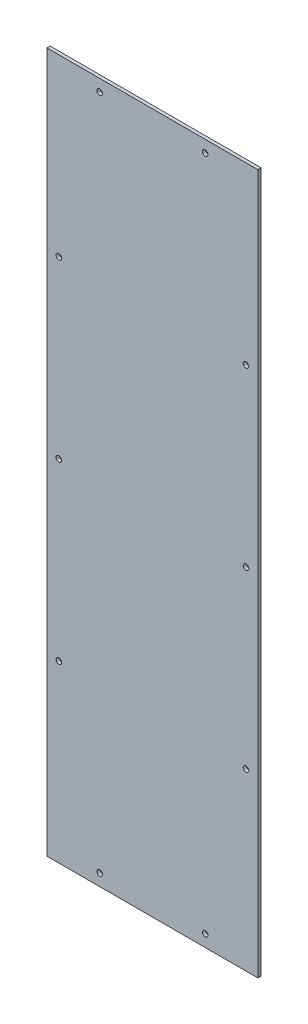
ISO-10303-21;
HEADER;
FILE_DESCRIPTION(('STEP AP214'),'2;1');
FILE_NAME('part.step','',(''),(''),'','','');
FILE_SCHEMA(('AUTOMOTIVE_DESIGN { 1 0 10303 214 1 1 1 1 }'));
ENDSEC;
DATA;
#1=APPLICATION_CONTEXT('core data for automotive mechanical design processes');
#2=APPLICATION_PROTOCOL_DEFINITION('international standard','automotive_design',2000,#1);
#3=PRODUCT_CONTEXT('',#1,'mechanical');
#4=PRODUCT('Part','Part','',(#3));
#5=PRODUCT_RELATED_PRODUCT_CATEGORY('part','',(#4));
#6=PRODUCT_DEFINITION_FORMATION('','',#4);
#7=PRODUCT_DEFINITION_CONTEXT('part definition',#1,'design');
#8=PRODUCT_DEFINITION('design','',#6,#7);
#9=PRODUCT_DEFINITION_SHAPE('','',#8);
#10=(LENGTH_UNIT() NAMED_UNIT(*) SI_UNIT(.MILLI.,.METRE.));
#11=(NAMED_UNIT(*) PLANE_ANGLE_UNIT() SI_UNIT($,.RADIAN.));
#12=(NAMED_UNIT(*) SI_UNIT($,.STERADIAN.) SOLID_ANGLE_UNIT());
#13=UNCERTAINTY_MEASURE_WITH_UNIT(LENGTH_MEASURE(1.E-05),#10,'distance_accuracy_value','');
#14=(GEOMETRIC_REPRESENTATION_CONTEXT(3) GLOBAL_UNCERTAINTY_ASSIGNED_CONTEXT((#13)) GLOBAL_UNIT_ASSIGNED_CONTEXT((#10,
#11,#12)) REPRESENTATION_CONTEXT('',''));
#15=CARTESIAN_POINT('',(0.,0.,0.));
#16=DIRECTION('',(0.,0.,1.));
#17=DIRECTION('',(1.,0.,0.));
#18=AXIS2_PLACEMENT_3D('',#15,#16,#17);
#19=CARTESIAN_POINT('',(-391.552346570397,-405.054151624549,4.));
#20=DIRECTION('',(1.,0.,0.));
#21=DIRECTION('',(0.,0.,-1.));
#22=AXIS2_PLACEMENT_3D('',#19,#20,#21);
#23=PLANE('',#22);
#24=DIRECTION('',(0.,-1.,0.));
#25=VECTOR('',#24,1.);
#26=CARTESIAN_POINT('',(-391.552346570397,-405.054151624549,0.));
#27=LINE('',#26,#25);
#28=CARTESIAN_POINT('',(-391.552346570397,474.945848375451,0.));
#29=VERTEX_POINT('',#28);
#30=CARTESIAN_POINT('',(-391.552346570397,-405.054151624549,0.));
#31=VERTEX_POINT('',#30);
#32=EDGE_CURVE('E112',#29,#31,#27,.T.);
#33=ORIENTED_EDGE('',*,*,#32,.T.);
#34=DIRECTION('',(0.,0.,-1.));
#35=VECTOR('',#34,1.);
#36=CARTESIAN_POINT('',(-391.552346570397,-405.054151624549,4.));
#37=LINE('',#36,#35);
#38=CARTESIAN_POINT('',(-391.552346570397,-405.054151624549,4.));
#39=VERTEX_POINT('',#38);
#40=EDGE_CURVE('E11',#39,#31,#37,.T.);
#41=ORIENTED_EDGE('',*,*,#40,.F.);
#42=DIRECTION('',(0.,-1.,0.));
#43=VECTOR('',#42,1.);
#44=CARTESIAN_POINT('',(-391.552346570397,-405.054151624549,4.));
#45=LINE('',#44,#43);
#46=CARTESIAN_POINT('',(-391.552346570397,474.945848375451,4.));
#47=VERTEX_POINT('',#46);
#48=EDGE_CURVE('E96',#47,#39,#45,.T.);
#49=ORIENTED_EDGE('',*,*,#48,.F.);
#50=DIRECTION('',(0.,0.,-1.));
#51=VECTOR('',#50,1.);
#52=CARTESIAN_POINT('',(-391.552346570397,474.945848375451,4.));
#53=LINE('',#52,#51);
#54=EDGE_CURVE('E108',#47,#29,#53,.T.);
#55=ORIENTED_EDGE('',*,*,#54,.T.);
#56=EDGE_LOOP('',(#33,#41,#49,#55));
#57=FACE_BOUND('',#56,.T.);
#58=ADVANCED_FACE('F44',(#57),#23,.F.);
#59=CARTESIAN_POINT('',(-126.272346570397,-405.054151624549,4.));
#60=DIRECTION('',(0.,1.,0.));
#61=DIRECTION('',(-1.,0.,0.));
#62=AXIS2_PLACEMENT_3D('',#59,#60,#61);
#63=PLANE('',#62);
#64=DIRECTION('',(1.,0.,0.));
#65=VECTOR('',#64,1.);
#66=CARTESIAN_POINT('',(-126.272346570397,-405.054151624549,0.));
#67=LINE('',#66,#65);
#68=CARTESIAN_POINT('',(-126.272346570397,-405.054151624549,0.));
#69=VERTEX_POINT('',#68);
#70=EDGE_CURVE('E101',#31,#69,#67,.T.);
#71=ORIENTED_EDGE('',*,*,#70,.T.);
#72=DIRECTION('',(0.,0.,-1.));
#73=VECTOR('',#72,1.);
#74=CARTESIAN_POINT('',(-126.272346570397,-405.054151624549,4.));
#75=LINE('',#74,#73);
#76=CARTESIAN_POINT('',(-126.272346570397,-405.054151624549,4.));
#77=VERTEX_POINT('',#76);
#78=EDGE_CURVE('E53',#77,#69,#75,.T.);
#79=ORIENTED_EDGE('',*,*,#78,.F.);
#80=DIRECTION('',(1.,0.,0.));
#81=VECTOR('',#80,1.);
#82=CARTESIAN_POINT('',(-126.272346570397,-405.054151624549,4.));
#83=LINE('',#82,#81);
#84=EDGE_CURVE('E91',#39,#77,#83,.T.);
#85=ORIENTED_EDGE('',*,*,#84,.F.);
#86=ORIENTED_EDGE('',*,*,#40,.T.);
#87=EDGE_LOOP('',(#71,#79,#85,#86));
#88=FACE_BOUND('',#87,.T.);
#89=ADVANCED_FACE('F100',(#88),#63,.F.);
#90=CARTESIAN_POINT('',(-126.272346570397,474.945848375451,4.));
#91=DIRECTION('',(-1.,0.,0.));
#92=DIRECTION('',(0.,-1.,0.));
#93=AXIS2_PLACEMENT_3D('',#90,#91,#92);
#94=PLANE('',#93);
#95=DIRECTION('',(0.,1.,0.));
#96=VECTOR('',#95,1.);
#97=CARTESIAN_POINT('',(-126.272346570397,474.945848375451,0.));
#98=LINE('',#97,#96);
#99=CARTESIAN_POINT('',(-126.272346570397,474.945848375451,0.));
#100=VERTEX_POINT('',#99);
#101=EDGE_CURVE('E78',#69,#100,#98,.T.);
#102=ORIENTED_EDGE('',*,*,#101,.T.);
#103=DIRECTION('',(0.,0.,-1.));
#104=VECTOR('',#103,1.);
#105=CARTESIAN_POINT('',(-126.272346570397,474.945848375451,4.));
#106=LINE('',#105,#104);
#107=CARTESIAN_POINT('',(-126.272346570397,474.945848375451,4.));
#108=VERTEX_POINT('',#107);
#109=EDGE_CURVE('E103',#108,#100,#106,.T.);
#110=ORIENTED_EDGE('',*,*,#109,.F.);
#111=DIRECTION('',(0.,1.,0.));
#112=VECTOR('',#111,1.);
#113=CARTESIAN_POINT('',(-126.272346570397,474.945848375451,4.));
#114=LINE('',#113,#112);
#115=EDGE_CURVE('E94',#77,#108,#114,.T.);
#116=ORIENTED_EDGE('',*,*,#115,.F.);
#117=ORIENTED_EDGE('',*,*,#78,.T.);
#118=EDGE_LOOP('',(#102,#110,#116,#117));
#119=FACE_BOUND('',#118,.T.);
#120=ADVANCED_FACE('F104',(#119),#94,.F.);
#121=CARTESIAN_POINT('',(-391.552346570397,474.945848375451,4.));
#122=DIRECTION('',(0.,-1.,0.));
#123=DIRECTION('',(1.,0.,0.));
#124=AXIS2_PLACEMENT_3D('',#121,#122,#123);
#125=PLANE('',#124);
#126=DIRECTION('',(-1.,0.,0.));
#127=VECTOR('',#126,1.);
#128=CARTESIAN_POINT('',(-391.552346570397,474.945848375451,0.));
#129=LINE('',#128,#127);
#130=EDGE_CURVE('E84',#100,#29,#129,.T.);
#131=ORIENTED_EDGE('',*,*,#130,.T.);
#132=ORIENTED_EDGE('',*,*,#54,.F.);
#133=DIRECTION('',(-1.,0.,0.));
#134=VECTOR('',#133,1.);
#135=CARTESIAN_POINT('',(-391.552346570397,474.945848375451,4.));
#136=LINE('',#135,#134);
#137=EDGE_CURVE('E61',#108,#47,#136,.T.);
#138=ORIENTED_EDGE('',*,*,#137,.F.);
#139=ORIENTED_EDGE('',*,*,#109,.T.);
#140=EDGE_LOOP('',(#131,#132,#138,#139));
#141=FACE_BOUND('',#140,.T.);
#142=ADVANCED_FACE('F126',(#141),#125,.F.);
#143=CARTESIAN_POINT('',(0.,0.,4.));
#144=DIRECTION('',(0.,0.,-1.));
#145=DIRECTION('',(-1.,0.,0.));
#146=AXIS2_PLACEMENT_3D('',#143,#144,#145);
#147=PLANE('',#146);
#148=CARTESIAN_POINT('',(-376.552346570397,34.9458483754512,4.));
#149=DIRECTION('',(0.,0.,1.));
#150=DIRECTION('',(1.,0.,0.));
#151=AXIS2_PLACEMENT_3D('',#148,#149,#150);
#152=CIRCLE('',#151,3.50000000000002);
#153=CARTESIAN_POINT('',(-373.052346570397,34.9458483754512,4.));
#154=VERTEX_POINT('',#153);
#155=EDGE_CURVE('E177',#154,#154,#152,.T.);
#156=ORIENTED_EDGE('',*,*,#155,.F.);
#157=EDGE_LOOP('',(#156));
#158=FACE_BOUND('',#157,.T.);
#159=CARTESIAN_POINT('',(-141.272346570397,254.945848375451,4.));
#160=DIRECTION('',(0.,0.,1.));
#161=DIRECTION('',(1.,0.,0.));
#162=AXIS2_PLACEMENT_3D('',#159,#160,#161);
#163=CIRCLE('',#162,3.49999999999999);
#164=CARTESIAN_POINT('',(-137.772346570397,254.945848375451,4.));
#165=VERTEX_POINT('',#164);
#166=EDGE_CURVE('E186',#165,#165,#163,.T.);
#167=ORIENTED_EDGE('',*,*,#166,.F.);
#168=EDGE_LOOP('',(#167));
#169=FACE_BOUND('',#168,.T.);
#170=CARTESIAN_POINT('',(-141.272346570397,-185.054151624549,4.));
#171=DIRECTION('',(0.,0.,1.));
#172=DIRECTION('',(1.,0.,0.));
#173=AXIS2_PLACEMENT_3D('',#170,#171,#172);
#174=CIRCLE('',#173,3.49999999999999);
#175=CARTESIAN_POINT('',(-137.772346570397,-185.054151624549,4.));
#176=VERTEX_POINT('',#175);
#177=EDGE_CURVE('E194',#176,#176,#174,.T.);
#178=ORIENTED_EDGE('',*,*,#177,.F.);
#179=EDGE_LOOP('',(#178));
#180=FACE_BOUND('',#179,.T.);
#181=CARTESIAN_POINT('',(-376.552346570397,-185.054151624549,4.));
#182=DIRECTION('',(0.,0.,1.));
#183=DIRECTION('',(1.,0.,0.));
#184=AXIS2_PLACEMENT_3D('',#181,#182,#183);
#185=CIRCLE('',#184,3.50000000000002);
#186=CARTESIAN_POINT('',(-373.052346570397,-185.054151624549,4.));
#187=VERTEX_POINT('',#186);
#188=EDGE_CURVE('E162',#187,#187,#185,.T.);
#189=ORIENTED_EDGE('',*,*,#188,.F.);
#190=EDGE_LOOP('',(#189));
#191=FACE_BOUND('',#190,.T.);
#192=CARTESIAN_POINT('',(-192.592346570397,459.945848375451,4.));
#193=DIRECTION('',(0.,0.,1.));
#194=DIRECTION('',(1.,0.,0.));
#195=AXIS2_PLACEMENT_3D('',#192,#193,#194);
#196=CIRCLE('',#195,3.49999999999999);
#197=CARTESIAN_POINT('',(-189.092346570397,459.945848375451,4.));
#198=VERTEX_POINT('',#197);
#199=EDGE_CURVE('E137',#198,#198,#196,.T.);
#200=ORIENTED_EDGE('',*,*,#199,.F.);
#201=EDGE_LOOP('',(#200));
#202=FACE_BOUND('',#201,.T.);
#203=CARTESIAN_POINT('',(-325.232346570397,-390.054151624549,4.));
#204=DIRECTION('',(0.,0.,1.));
#205=DIRECTION('',(1.,0.,0.));
#206=AXIS2_PLACEMENT_3D('',#203,#204,#205);
#207=CIRCLE('',#206,3.50000000000002);
#208=CARTESIAN_POINT('',(-321.732346570397,-390.054151624549,4.));
#209=VERTEX_POINT('',#208);
#210=EDGE_CURVE('E145',#209,#209,#207,.T.);
#211=ORIENTED_EDGE('',*,*,#210,.F.);
#212=EDGE_LOOP('',(#211));
#213=FACE_BOUND('',#212,.T.);
#214=CARTESIAN_POINT('',(-192.592346570397,-390.054151624549,4.));
#215=DIRECTION('',(0.,0.,1.));
#216=DIRECTION('',(1.,0.,0.));
#217=AXIS2_PLACEMENT_3D('',#214,#215,#216);
#218=CIRCLE('',#217,3.49999999999999);
#219=CARTESIAN_POINT('',(-189.092346570397,-390.054151624549,4.));
#220=VERTEX_POINT('',#219);
#221=EDGE_CURVE('E146',#220,#220,#218,.T.);
#222=ORIENTED_EDGE('',*,*,#221,.F.);
#223=EDGE_LOOP('',(#222));
#224=FACE_BOUND('',#223,.T.);
#225=CARTESIAN_POINT('',(-376.552346570397,254.945848375451,4.));
#226=DIRECTION('',(0.,0.,1.));
#227=DIRECTION('',(1.,0.,0.));
#228=AXIS2_PLACEMENT_3D('',#225,#226,#227);
#229=CIRCLE('',#228,3.50000000000002);
#230=CARTESIAN_POINT('',(-373.052346570397,254.945848375451,4.));
#231=VERTEX_POINT('',#230);
#232=EDGE_CURVE('E161',#231,#231,#229,.T.);
#233=ORIENTED_EDGE('',*,*,#232,.F.);
#234=EDGE_LOOP('',(#233));
#235=FACE_BOUND('',#234,.T.);
#236=CARTESIAN_POINT('',(-141.272346570397,34.9458483754512,4.));
#237=DIRECTION('',(0.,0.,1.));
#238=DIRECTION('',(1.,0.,0.));
#239=AXIS2_PLACEMENT_3D('',#236,#237,#238);
#240=CIRCLE('',#239,3.49999999999999);
#241=CARTESIAN_POINT('',(-137.772346570397,34.9458483754512,4.));
#242=VERTEX_POINT('',#241);
#243=EDGE_CURVE('E178',#242,#242,#240,.T.);
#244=ORIENTED_EDGE('',*,*,#243,.F.);
#245=EDGE_LOOP('',(#244));
#246=FACE_BOUND('',#245,.T.);
#247=CARTESIAN_POINT('',(-325.232346570397,459.945848375451,4.));
#248=DIRECTION('',(0.,0.,1.));
#249=DIRECTION('',(1.,0.,0.));
#250=AXIS2_PLACEMENT_3D('',#247,#248,#249);
#251=CIRCLE('',#250,3.50000000000002);
#252=CARTESIAN_POINT('',(-321.732346570397,459.945848375451,4.));
#253=VERTEX_POINT('',#252);
#254=EDGE_CURVE('E133',#253,#253,#251,.T.);
#255=ORIENTED_EDGE('',*,*,#254,.F.);
#256=EDGE_LOOP('',(#255));
#257=FACE_BOUND('',#256,.T.);
#258=ORIENTED_EDGE('',*,*,#48,.T.);
#259=ORIENTED_EDGE('',*,*,#84,.T.);
#260=ORIENTED_EDGE('',*,*,#115,.T.);
#261=ORIENTED_EDGE('',*,*,#137,.T.);
#262=EDGE_LOOP('',(#258,#259,#260,#261));
#263=FACE_BOUND('',#262,.T.);
#264=ADVANCED_FACE('F92',(#158,#169,#180,#191,#202,#213,#224,#235,#246,#257,#263),#147,.F.);
#265=CARTESIAN_POINT('',(0.,0.,0.));
#266=DIRECTION('',(0.,0.,-1.));
#267=DIRECTION('',(-1.,0.,0.));
#268=AXIS2_PLACEMENT_3D('',#265,#266,#267);
#269=PLANE('',#268);
#270=CARTESIAN_POINT('',(-376.552346570397,34.9458483754512,0.));
#271=DIRECTION('',(0.,0.,1.));
#272=DIRECTION('',(1.,0.,0.));
#273=AXIS2_PLACEMENT_3D('',#270,#271,#272);
#274=CIRCLE('',#273,3.50000000000002);
#275=CARTESIAN_POINT('',(-373.052346570397,34.9458483754512,0.));
#276=VERTEX_POINT('',#275);
#277=EDGE_CURVE('E173',#276,#276,#274,.T.);
#278=ORIENTED_EDGE('',*,*,#277,.T.);
#279=EDGE_LOOP('',(#278));
#280=FACE_BOUND('',#279,.T.);
#281=CARTESIAN_POINT('',(-141.272346570397,254.945848375451,0.));
#282=DIRECTION('',(0.,0.,1.));
#283=DIRECTION('',(1.,0.,0.));
#284=AXIS2_PLACEMENT_3D('',#281,#282,#283);
#285=CIRCLE('',#284,3.49999999999999);
#286=CARTESIAN_POINT('',(-137.772346570397,254.945848375451,0.));
#287=VERTEX_POINT('',#286);
#288=EDGE_CURVE('E182',#287,#287,#285,.T.);
#289=ORIENTED_EDGE('',*,*,#288,.T.);
#290=EDGE_LOOP('',(#289));
#291=FACE_BOUND('',#290,.T.);
#292=CARTESIAN_POINT('',(-141.272346570397,-185.054151624549,0.));
#293=DIRECTION('',(0.,0.,1.));
#294=DIRECTION('',(1.,0.,0.));
#295=AXIS2_PLACEMENT_3D('',#292,#293,#294);
#296=CIRCLE('',#295,3.49999999999999);
#297=CARTESIAN_POINT('',(-137.772346570397,-185.054151624549,0.));
#298=VERTEX_POINT('',#297);
#299=EDGE_CURVE('E190',#298,#298,#296,.T.);
#300=ORIENTED_EDGE('',*,*,#299,.T.);
#301=EDGE_LOOP('',(#300));
#302=FACE_BOUND('',#301,.T.);
#303=CARTESIAN_POINT('',(-376.552346570397,-185.054151624549,0.));
#304=DIRECTION('',(0.,0.,1.));
#305=DIRECTION('',(1.,0.,0.));
#306=AXIS2_PLACEMENT_3D('',#303,#304,#305);
#307=CIRCLE('',#306,3.50000000000002);
#308=CARTESIAN_POINT('',(-373.052346570397,-185.054151624549,0.));
#309=VERTEX_POINT('',#308);
#310=EDGE_CURVE('E198',#309,#309,#307,.T.);
#311=ORIENTED_EDGE('',*,*,#310,.T.);
#312=EDGE_LOOP('',(#311));
#313=FACE_BOUND('',#312,.T.);
#314=CARTESIAN_POINT('',(-192.592346570397,459.945848375451,0.));
#315=DIRECTION('',(0.,0.,1.));
#316=DIRECTION('',(1.,0.,0.));
#317=AXIS2_PLACEMENT_3D('',#314,#315,#316);
#318=CIRCLE('',#317,3.49999999999999);
#319=CARTESIAN_POINT('',(-189.092346570397,459.945848375451,0.));
#320=VERTEX_POINT('',#319);
#321=EDGE_CURVE('E150',#320,#320,#318,.T.);
#322=ORIENTED_EDGE('',*,*,#321,.T.);
#323=EDGE_LOOP('',(#322));
#324=FACE_BOUND('',#323,.T.);
#325=CARTESIAN_POINT('',(-325.232346570397,-390.054151624549,0.));
#326=DIRECTION('',(0.,0.,1.));
#327=DIRECTION('',(1.,0.,0.));
#328=AXIS2_PLACEMENT_3D('',#325,#326,#327);
#329=CIRCLE('',#328,3.50000000000002);
#330=CARTESIAN_POINT('',(-321.732346570397,-390.054151624549,0.));
#331=VERTEX_POINT('',#330);
#332=EDGE_CURVE('E141',#331,#331,#329,.T.);
#333=ORIENTED_EDGE('',*,*,#332,.T.);
#334=EDGE_LOOP('',(#333));
#335=FACE_BOUND('',#334,.T.);
#336=CARTESIAN_POINT('',(-192.592346570397,-390.054151624549,0.));
#337=DIRECTION('',(0.,0.,1.));
#338=DIRECTION('',(1.,0.,0.));
#339=AXIS2_PLACEMENT_3D('',#336,#337,#338);
#340=CIRCLE('',#339,3.49999999999999);
#341=CARTESIAN_POINT('',(-189.092346570397,-390.054151624549,0.));
#342=VERTEX_POINT('',#341);
#343=EDGE_CURVE('E166',#342,#342,#340,.T.);
#344=ORIENTED_EDGE('',*,*,#343,.T.);
#345=EDGE_LOOP('',(#344));
#346=FACE_BOUND('',#345,.T.);
#347=CARTESIAN_POINT('',(-376.552346570397,254.945848375451,0.));
#348=DIRECTION('',(0.,0.,1.));
#349=DIRECTION('',(1.,0.,0.));
#350=AXIS2_PLACEMENT_3D('',#347,#348,#349);
#351=CIRCLE('',#350,3.50000000000002);
#352=CARTESIAN_POINT('',(-373.052346570397,254.945848375451,0.));
#353=VERTEX_POINT('',#352);
#354=EDGE_CURVE('E157',#353,#353,#351,.T.);
#355=ORIENTED_EDGE('',*,*,#354,.T.);
#356=EDGE_LOOP('',(#355));
#357=FACE_BOUND('',#356,.T.);
#358=CARTESIAN_POINT('',(-141.272346570397,34.9458483754512,0.));
#359=DIRECTION('',(0.,0.,1.));
#360=DIRECTION('',(1.,0.,0.));
#361=AXIS2_PLACEMENT_3D('',#358,#359,#360);
#362=CIRCLE('',#361,3.49999999999999);
#363=CARTESIAN_POINT('',(-137.772346570397,34.9458483754512,0.));
#364=VERTEX_POINT('',#363);
#365=EDGE_CURVE('E205',#364,#364,#362,.T.);
#366=ORIENTED_EDGE('',*,*,#365,.T.);
#367=EDGE_LOOP('',(#366));
#368=FACE_BOUND('',#367,.T.);
#369=CARTESIAN_POINT('',(-325.232346570397,459.945848375451,0.));
#370=DIRECTION('',(0.,0.,1.));
#371=DIRECTION('',(1.,0.,0.));
#372=AXIS2_PLACEMENT_3D('',#369,#370,#371);
#373=CIRCLE('',#372,3.50000000000002);
#374=CARTESIAN_POINT('',(-321.732346570397,459.945848375451,0.));
#375=VERTEX_POINT('',#374);
#376=EDGE_CURVE('E116',#375,#375,#373,.T.);
#377=ORIENTED_EDGE('',*,*,#376,.T.);
#378=EDGE_LOOP('',(#377));
#379=FACE_BOUND('',#378,.T.);
#380=ORIENTED_EDGE('',*,*,#32,.F.);
#381=ORIENTED_EDGE('',*,*,#130,.F.);
#382=ORIENTED_EDGE('',*,*,#101,.F.);
#383=ORIENTED_EDGE('',*,*,#70,.F.);
#384=EDGE_LOOP('',(#380,#381,#382,#383));
#385=FACE_BOUND('',#384,.T.);
#386=ADVANCED_FACE('F129',(#280,#291,#302,#313,#324,#335,#346,#357,#368,#379,#385),#269,.T.);
#387=CARTESIAN_POINT('',(-325.232346570397,459.945848375451,0.));
#388=DIRECTION('',(0.,0.,1.));
#389=DIRECTION('',(1.,0.,0.));
#390=AXIS2_PLACEMENT_3D('',#387,#388,#389);
#391=CYLINDRICAL_SURFACE('',#390,3.50000000000002);
#392=ORIENTED_EDGE('',*,*,#376,.F.);
#393=EDGE_LOOP('',(#392));
#394=FACE_BOUND('',#393,.T.);
#395=ORIENTED_EDGE('',*,*,#254,.T.);
#396=EDGE_LOOP('',(#395));
#397=FACE_BOUND('',#396,.T.);
#398=ADVANCED_FACE('F221',(#394,#397),#391,.F.);
#399=CARTESIAN_POINT('',(-141.272346570397,34.9458483754512,0.));
#400=DIRECTION('',(0.,0.,1.));
#401=DIRECTION('',(1.,0.,0.));
#402=AXIS2_PLACEMENT_3D('',#399,#400,#401);
#403=CYLINDRICAL_SURFACE('',#402,3.49999999999999);
#404=ORIENTED_EDGE('',*,*,#365,.F.);
#405=EDGE_LOOP('',(#404));
#406=FACE_BOUND('',#405,.T.);
#407=ORIENTED_EDGE('',*,*,#243,.T.);
#408=EDGE_LOOP('',(#407));
#409=FACE_BOUND('',#408,.T.);
#410=ADVANCED_FACE('F213',(#406,#409),#403,.F.);
#411=CARTESIAN_POINT('',(-376.552346570397,254.945848375451,0.));
#412=DIRECTION('',(0.,0.,1.));
#413=DIRECTION('',(1.,0.,0.));
#414=AXIS2_PLACEMENT_3D('',#411,#412,#413);
#415=CYLINDRICAL_SURFACE('',#414,3.50000000000002);
#416=ORIENTED_EDGE('',*,*,#354,.F.);
#417=EDGE_LOOP('',(#416));
#418=FACE_BOUND('',#417,.T.);
#419=ORIENTED_EDGE('',*,*,#232,.T.);
#420=EDGE_LOOP('',(#419));
#421=FACE_BOUND('',#420,.T.);
#422=ADVANCED_FACE('F229',(#418,#421),#415,.F.);
#423=CARTESIAN_POINT('',(-192.592346570397,-390.054151624549,0.));
#424=DIRECTION('',(0.,0.,1.));
#425=DIRECTION('',(1.,0.,0.));
#426=AXIS2_PLACEMENT_3D('',#423,#424,#425);
#427=CYLINDRICAL_SURFACE('',#426,3.49999999999999);
#428=ORIENTED_EDGE('',*,*,#343,.F.);
#429=EDGE_LOOP('',(#428));
#430=FACE_BOUND('',#429,.T.);
#431=ORIENTED_EDGE('',*,*,#221,.T.);
#432=EDGE_LOOP('',(#431));
#433=FACE_BOUND('',#432,.T.);
#434=ADVANCED_FACE('F280',(#430,#433),#427,.F.);
#435=CARTESIAN_POINT('',(-325.232346570397,-390.054151624549,0.));
#436=DIRECTION('',(0.,0.,1.));
#437=DIRECTION('',(1.,0.,0.));
#438=AXIS2_PLACEMENT_3D('',#435,#436,#437);
#439=CYLINDRICAL_SURFACE('',#438,3.50000000000002);
#440=ORIENTED_EDGE('',*,*,#332,.F.);
#441=EDGE_LOOP('',(#440));
#442=FACE_BOUND('',#441,.T.);
#443=ORIENTED_EDGE('',*,*,#210,.T.);
#444=EDGE_LOOP('',(#443));
#445=FACE_BOUND('',#444,.T.);
#446=ADVANCED_FACE('F290',(#442,#445),#439,.F.);
#447=CARTESIAN_POINT('',(-192.592346570397,459.945848375451,0.));
#448=DIRECTION('',(0.,0.,1.));
#449=DIRECTION('',(1.,0.,0.));
#450=AXIS2_PLACEMENT_3D('',#447,#448,#449);
#451=CYLINDRICAL_SURFACE('',#450,3.49999999999999);
#452=ORIENTED_EDGE('',*,*,#321,.F.);
#453=EDGE_LOOP('',(#452));
#454=FACE_BOUND('',#453,.T.);
#455=ORIENTED_EDGE('',*,*,#199,.T.);
#456=EDGE_LOOP('',(#455));
#457=FACE_BOUND('',#456,.T.);
#458=ADVANCED_FACE('F300',(#454,#457),#451,.F.);
#459=CARTESIAN_POINT('',(-376.552346570397,-185.054151624549,0.));
#460=DIRECTION('',(0.,0.,1.));
#461=DIRECTION('',(1.,0.,0.));
#462=AXIS2_PLACEMENT_3D('',#459,#460,#461);
#463=CYLINDRICAL_SURFACE('',#462,3.50000000000002);
#464=ORIENTED_EDGE('',*,*,#310,.F.);
#465=EDGE_LOOP('',(#464));
#466=FACE_BOUND('',#465,.T.);
#467=ORIENTED_EDGE('',*,*,#188,.T.);
#468=EDGE_LOOP('',(#467));
#469=FACE_BOUND('',#468,.T.);
#470=ADVANCED_FACE('F309',(#466,#469),#463,.F.);
#471=CARTESIAN_POINT('',(-141.272346570397,-185.054151624549,0.));
#472=DIRECTION('',(0.,0.,1.));
#473=DIRECTION('',(1.,0.,0.));
#474=AXIS2_PLACEMENT_3D('',#471,#472,#473);
#475=CYLINDRICAL_SURFACE('',#474,3.49999999999999);
#476=ORIENTED_EDGE('',*,*,#299,.F.);
#477=EDGE_LOOP('',(#476));
#478=FACE_BOUND('',#477,.T.);
#479=ORIENTED_EDGE('',*,*,#177,.T.);
#480=EDGE_LOOP('',(#479));
#481=FACE_BOUND('',#480,.T.);
#482=ADVANCED_FACE('F319',(#478,#481),#475,.F.);
#483=CARTESIAN_POINT('',(-141.272346570397,254.945848375451,0.));
#484=DIRECTION('',(0.,0.,1.));
#485=DIRECTION('',(1.,0.,0.));
#486=AXIS2_PLACEMENT_3D('',#483,#484,#485);
#487=CYLINDRICAL_SURFACE('',#486,3.49999999999999);
#488=ORIENTED_EDGE('',*,*,#288,.F.);
#489=EDGE_LOOP('',(#488));
#490=FACE_BOUND('',#489,.T.);
#491=ORIENTED_EDGE('',*,*,#166,.T.);
#492=EDGE_LOOP('',(#491));
#493=FACE_BOUND('',#492,.T.);
#494=ADVANCED_FACE('F329',(#490,#493),#487,.F.);
#495=CARTESIAN_POINT('',(-376.552346570397,34.9458483754512,0.));
#496=DIRECTION('',(0.,0.,1.));
#497=DIRECTION('',(1.,0.,0.));
#498=AXIS2_PLACEMENT_3D('',#495,#496,#497);
#499=CYLINDRICAL_SURFACE('',#498,3.50000000000002);
#500=ORIENTED_EDGE('',*,*,#277,.F.);
#501=EDGE_LOOP('',(#500));
#502=FACE_BOUND('',#501,.T.);
#503=ORIENTED_EDGE('',*,*,#155,.T.);
#504=EDGE_LOOP('',(#503));
#505=FACE_BOUND('',#504,.T.);
#506=ADVANCED_FACE('F339',(#502,#505),#499,.F.);
#507=CLOSED_SHELL('',(#58,#89,#120,#142,#264,#386,#398,#410,#422,#434,#446,#458,#470,#482,#494,#506));
#508=MANIFOLD_SOLID_BREP('B2',#507);
#509=ADVANCED_BREP_SHAPE_REPRESENTATION('',(#18,#508),#14);
#510=SHAPE_DEFINITION_REPRESENTATION(#9,#509);
ENDSEC;
END-ISO-10303-21;
